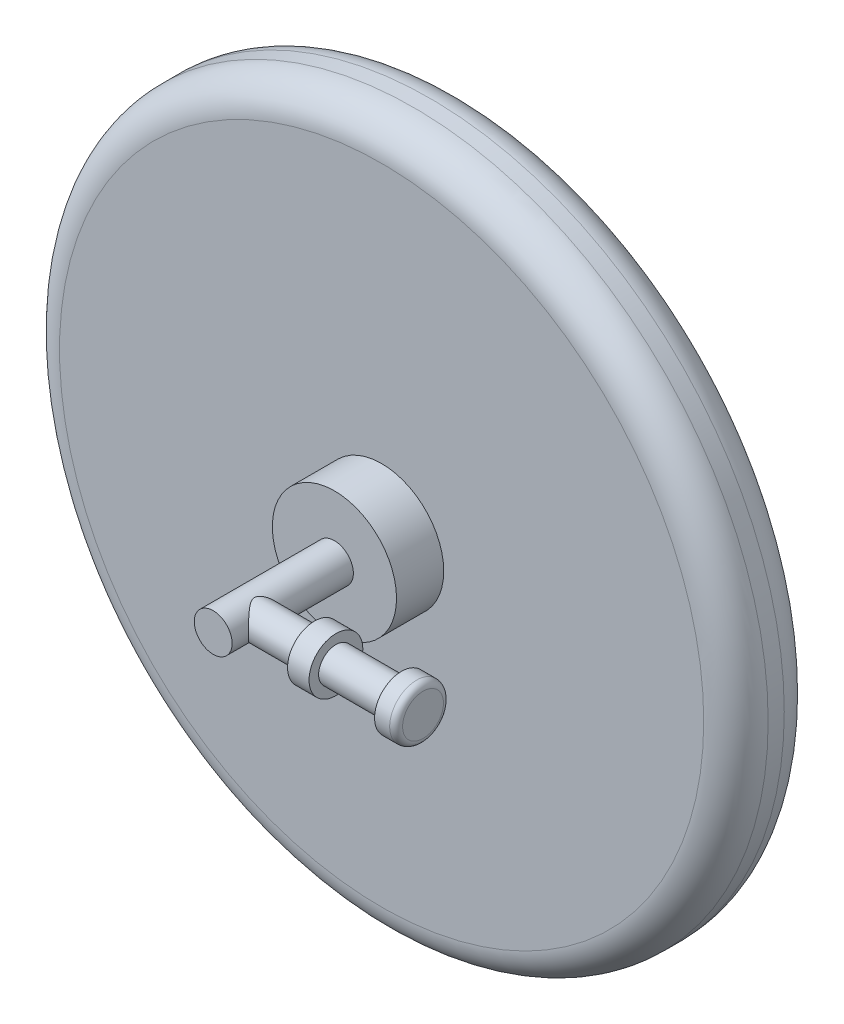
ISO-10303-21;
HEADER;
FILE_DESCRIPTION(('STEP AP214'),'2;1');
FILE_NAME('part.step','',(''),(''),'','','');
FILE_SCHEMA(('AUTOMOTIVE_DESIGN { 1 0 10303 214 1 1 1 1 }'));
ENDSEC;
DATA;
#1=APPLICATION_CONTEXT('core data for automotive mechanical design processes');
#2=APPLICATION_PROTOCOL_DEFINITION('international standard','automotive_design',2000,#1);
#3=PRODUCT_CONTEXT('',#1,'mechanical');
#4=PRODUCT('Part','Part','',(#3));
#5=PRODUCT_RELATED_PRODUCT_CATEGORY('part','',(#4));
#6=PRODUCT_DEFINITION_FORMATION('','',#4);
#7=PRODUCT_DEFINITION_CONTEXT('part definition',#1,'design');
#8=PRODUCT_DEFINITION('design','',#6,#7);
#9=PRODUCT_DEFINITION_SHAPE('','',#8);
#10=(LENGTH_UNIT() NAMED_UNIT(*) SI_UNIT(.MILLI.,.METRE.));
#11=(NAMED_UNIT(*) PLANE_ANGLE_UNIT() SI_UNIT($,.RADIAN.));
#12=(NAMED_UNIT(*) SI_UNIT($,.STERADIAN.) SOLID_ANGLE_UNIT());
#13=UNCERTAINTY_MEASURE_WITH_UNIT(LENGTH_MEASURE(1.E-05),#10,'distance_accuracy_value','');
#14=(GEOMETRIC_REPRESENTATION_CONTEXT(3) GLOBAL_UNCERTAINTY_ASSIGNED_CONTEXT((#13)) GLOBAL_UNIT_ASSIGNED_CONTEXT((#10,
#11,#12)) REPRESENTATION_CONTEXT('',''));
#15=CARTESIAN_POINT('',(0.,0.,0.));
#16=DIRECTION('',(0.,0.,1.));
#17=DIRECTION('',(1.,0.,0.));
#18=AXIS2_PLACEMENT_3D('',#15,#16,#17);
#19=CARTESIAN_POINT('',(53.3399999999999,-3.33066907387547E-13,131.7371));
#20=DIRECTION('',(1.,0.,0.));
#21=DIRECTION('',(0.,0.,-1.));
#22=AXIS2_PLACEMENT_3D('',#19,#20,#21);
#23=CYLINDRICAL_SURFACE('',#22,21.209);
#24=CARTESIAN_POINT('',(53.3399999999999,-3.33066907387547E-13,131.7371));
#25=DIRECTION('',(1.,0.,0.));
#26=DIRECTION('',(0.,0.,-1.));
#27=AXIS2_PLACEMENT_3D('',#24,#25,#26);
#28=CIRCLE('',#27,21.209);
#29=CARTESIAN_POINT('',(53.3399999999999,-3.33103699137749E-13,110.5281));
#30=VERTEX_POINT('',#29);
#31=EDGE_CURVE('E112',#30,#30,#28,.T.);
#32=ORIENTED_EDGE('',*,*,#31,.T.);
#33=EDGE_LOOP('',(#32));
#34=FACE_BOUND('',#33,.T.);
#35=CARTESIAN_POINT('',(70.3072,0.,131.7371));
#36=DIRECTION('',(1.,0.,0.));
#37=DIRECTION('',(0.,0.,-1.));
#38=AXIS2_PLACEMENT_3D('',#35,#36,#37);
#39=CIRCLE('',#38,21.209);
#40=CARTESIAN_POINT('',(70.3072,0.,110.5281));
#41=VERTEX_POINT('',#40);
#42=EDGE_CURVE('E115',#41,#41,#39,.T.);
#43=ORIENTED_EDGE('',*,*,#42,.F.);
#44=EDGE_LOOP('',(#43));
#45=FACE_BOUND('',#44,.T.);
#46=ADVANCED_FACE('F50',(#34,#45),#23,.T.);
#47=CARTESIAN_POINT('',(133.8072,-1.11022302462516E-13,131.7371));
#48=DIRECTION('',(-1.,0.,0.));
#49=DIRECTION('',(0.,0.,1.));
#50=AXIS2_PLACEMENT_3D('',#47,#48,#49);
#51=CYLINDRICAL_SURFACE('',#50,13.6525);
#52=CARTESIAN_POINT('',(14.9224999999986,-2.22044604925031E-13,145.389600000003));
#53=CARTESIAN_POINT('',(14.9224975751914,-0.314679827538271,145.389597544321));
#54=CARTESIAN_POINT('',(14.9125248063025,-0.62939866485721,145.378699056492));
#55=CARTESIAN_POINT('',(14.872855245779,-1.25611457254504,145.335322250677));
#56=CARTESIAN_POINT('',(14.8431551464077,-1.56811117757989,145.302840313733));
#57=CARTESIAN_POINT('',(14.7646687882556,-2.18699027334549,145.216918252252));
#58=CARTESIAN_POINT('',(14.7158686506134,-2.49386887568357,145.163462887503));
#59=CARTESIAN_POINT('',(14.6002191255131,-3.09996902881604,145.036604778444));
#60=CARTESIAN_POINT('',(14.533370060317,-3.39919071621962,144.963202390286));
#61=CARTESIAN_POINT('',(14.3834211802936,-3.98614699271213,144.798253375782));
#62=CARTESIAN_POINT('',(14.3004302572887,-4.27394379979169,144.706828276386));
#63=CARTESIAN_POINT('',(14.1193732823536,-4.83861850549161,144.50691781969));
#64=CARTESIAN_POINT('',(14.0213074854895,-5.11549658875677,144.398432751044));
#65=CARTESIAN_POINT('',(13.8116051417991,-5.65729319431543,144.165805616674));
#66=CARTESIAN_POINT('',(13.6999667353727,-5.92221007095474,144.041661405385));
#67=CARTESIAN_POINT('',(13.4646440151978,-6.43934111758879,143.779100512654));
#68=CARTESIAN_POINT('',(13.3409569739976,-6.69155239171886,143.640680599202));
#69=CARTESIAN_POINT('',(13.0313300560876,-7.28123667868312,143.292787041987));
#70=CARTESIAN_POINT('',(12.8403048273695,-7.61237856456286,143.077067053602));
#71=CARTESIAN_POINT('',(12.4414146958091,-8.24822303258853,142.623341396287));
#72=CARTESIAN_POINT('',(12.2335435749122,-8.5529157652426,142.385327493264));
#73=CARTESIAN_POINT('',(11.8041813694739,-9.13639753330821,141.889142232118));
#74=CARTESIAN_POINT('',(11.5826633068085,-9.41513233286339,141.630930655461));
#75=CARTESIAN_POINT('',(11.1298754337393,-9.94628830119558,141.096799307306));
#76=CARTESIAN_POINT('',(10.8986068580564,-10.1987127877111,140.820881775641));
#77=CARTESIAN_POINT('',(10.4240154952952,-10.6835731441048,140.24573822815));
#78=CARTESIAN_POINT('',(10.1805364245874,-10.9153770148227,139.946109597953));
#79=CARTESIAN_POINT('',(9.69072223121226,-11.3524721048894,139.330176359488));
#80=CARTESIAN_POINT('',(9.44438644512785,-11.5577570256918,139.013867814584));
#81=CARTESIAN_POINT('',(8.95397020950194,-11.9417003681107,138.364954708499));
#82=CARTESIAN_POINT('',(8.70988644105954,-12.1204071464977,138.032381242719));
#83=CARTESIAN_POINT('',(8.22954806902558,-12.4515195947944,137.349103969467));
#84=CARTESIAN_POINT('',(7.99328919724522,-12.6039398005091,136.998410322335));
#85=CARTESIAN_POINT('',(7.65376157648507,-12.8108609593027,136.460281669942));
#86=CARTESIAN_POINT('',(7.5441114608094,-12.8756601452394,136.280786964625));
#87=CARTESIAN_POINT('',(7.33035676779226,-12.9985397446387,135.916302754386));
#88=CARTESIAN_POINT('',(7.22625110271128,-13.0566214786056,135.731314338424));
#89=CARTESIAN_POINT('',(7.02538810098373,-13.1657888798679,135.355258483413));
#90=CARTESIAN_POINT('',(6.92863255718546,-13.2168728426859,135.16418957723));
#91=CARTESIAN_POINT('',(6.74491107072552,-13.3115690580062,134.77567321256));
#92=CARTESIAN_POINT('',(6.65794392979192,-13.3551822254066,134.578226538642));
#93=CARTESIAN_POINT('',(6.44304080054155,-13.4607039111655,134.042774063443));
#94=CARTESIAN_POINT('',(6.32625804897889,-13.5155247135241,133.698511814645));
#95=CARTESIAN_POINT('',(6.18995851577387,-13.5782160421476,133.170350197585));
#96=CARTESIAN_POINT('',(6.15102555420764,-13.5958479810356,132.992533056309));
#97=CARTESIAN_POINT('',(6.08795464387762,-13.6242069199327,132.633790605558));
#98=CARTESIAN_POINT('',(6.06380775496729,-13.6349380925697,132.45286724238));
#99=CARTESIAN_POINT('',(6.03153668170797,-13.6492453893752,132.087334836899));
#100=CARTESIAN_POINT('',(6.02358704236491,-13.6527435752274,131.902707075618));
#101=CARTESIAN_POINT('',(6.02475068554445,-13.652230019234,131.533519172679));
#102=CARTESIAN_POINT('',(6.03386370155856,-13.6482183946872,131.34895903001));
#103=CARTESIAN_POINT('',(6.06858959471379,-13.6328125458015,130.98139833469));
#104=CARTESIAN_POINT('',(6.09423245018983,-13.6214049079168,130.798401228955));
#105=CARTESIAN_POINT('',(6.160515198491,-13.5915549658269,130.435745217418));
#106=CARTESIAN_POINT('',(6.20115831634961,-13.5731111488252,130.256087038211));
#107=CARTESIAN_POINT('',(6.30936162816279,-13.5232196905045,129.848441393671));
#108=CARTESIAN_POINT('',(6.38132898217333,-13.4895383841549,129.621903527837));
#109=CARTESIAN_POINT('',(6.54234657955825,-13.4121834003213,129.176786863856));
#110=CARTESIAN_POINT('',(6.63140456322269,-13.3685051935405,128.958211725575));
#111=CARTESIAN_POINT('',(6.82273728916248,-13.2718794155735,128.528256368954));
#112=CARTESIAN_POINT('',(6.92505309742504,-13.2189028540759,128.316901198225));
#113=CARTESIAN_POINT('',(7.13936406545717,-13.1043985138799,127.901485262765));
#114=CARTESIAN_POINT('',(7.25136337510796,-13.0428670620311,127.697427678915));
#115=CARTESIAN_POINT('',(7.48141855114953,-12.9122704448851,127.297747305997));
#116=CARTESIAN_POINT('',(7.59941486024846,-12.8432737452117,127.102067573935));
#117=CARTESIAN_POINT('',(7.84036293038834,-12.6976206551566,126.716784776132));
#118=CARTESIAN_POINT('',(7.96331394929247,-12.6209654093779,126.527180807918));
#119=CARTESIAN_POINT('',(8.33749198574688,-12.3796260607544,125.966346525278));
#120=CARTESIAN_POINT('',(8.59388647309425,-12.2036557786005,125.60335837892));
#121=CARTESIAN_POINT('',(9.11188602043251,-11.8219481969501,124.896506241827));
#122=CARTESIAN_POINT('',(9.37349811113551,-11.6161680105925,124.55267080959));
#123=CARTESIAN_POINT('',(9.89547051359249,-11.1748581431841,123.883838147315));
#124=CARTESIAN_POINT('',(10.1558312008122,-10.9393380495099,123.558834895311));
#125=CARTESIAN_POINT('',(10.6891571293299,-10.4197624162495,122.904994568979));
#126=CARTESIAN_POINT('',(10.9616661171721,-10.1334251168763,122.577590530688));
#127=CARTESIAN_POINT('',(11.4943099734102,-9.52498689632797,121.946415219674));
#128=CARTESIAN_POINT('',(11.754441286443,-9.2028757870134,121.642650721438));
#129=CARTESIAN_POINT('',(12.2559919358447,-8.52346402048736,121.06282510077));
#130=CARTESIAN_POINT('',(12.497467473899,-8.16627705802708,120.786679968317));
#131=CARTESIAN_POINT('',(12.9567309026796,-7.41601450488629,120.265316414904));
#132=CARTESIAN_POINT('',(13.1745352929312,-7.02296426814433,120.020076432822));
#133=CARTESIAN_POINT('',(13.5056926892011,-6.35304608521437,119.649186862845));
#134=CARTESIAN_POINT('',(13.6280225892896,-6.08654375512208,119.512701523737));
#135=CARTESIAN_POINT('',(13.8590648023319,-5.54032391260236,119.255649507421));
#136=CARTESIAN_POINT('',(13.9677812156144,-5.26061041445309,119.135078036425));
#137=CARTESIAN_POINT('',(14.1698915228203,-4.68903268927405,118.911427865584));
#138=CARTESIAN_POINT('',(14.2632916098271,-4.39717343347163,118.808342094897));
#139=CARTESIAN_POINT('',(14.433186191478,-3.80259405092404,118.621149455957));
#140=CARTESIAN_POINT('',(14.5096801511983,-3.4998735808732,118.53704318823));
#141=CARTESIAN_POINT('',(14.6447612255352,-2.88311775544877,118.388702015802));
#142=CARTESIAN_POINT('',(14.7032083015935,-2.56901405836682,118.324622468221));
#143=CARTESIAN_POINT('',(14.8001209109226,-1.93405049569998,118.218453629828));
#144=CARTESIAN_POINT('',(14.8385865008323,-1.61319064926852,118.176364276684));
#145=CARTESIAN_POINT('',(14.8946184851817,-0.967612791381765,118.115075033616));
#146=CARTESIAN_POINT('',(14.9121940412547,-0.642896534366328,118.095865109574));
#147=CARTESIAN_POINT('',(14.926041805812,0.00751748209440716,118.080728430059));
#148=CARTESIAN_POINT('',(14.9223160443156,0.333215145054901,118.084799455908));
#149=CARTESIAN_POINT('',(14.895263352011,0.946347701304549,118.114374559911));
#150=CARTESIAN_POINT('',(14.8741654311028,1.23400450964006,118.137441346136));
#151=CARTESIAN_POINT('',(14.8156434578172,1.80561275932831,118.201472551436));
#152=CARTESIAN_POINT('',(14.7782208528509,2.08956452688634,118.242435383778));
#153=CARTESIAN_POINT('',(14.68773338588,2.65190843234713,118.341590589384));
#154=CARTESIAN_POINT('',(14.6346676150303,2.930300246221,118.399783963717));
#155=CARTESIAN_POINT('',(14.5138059764934,3.47988791681101,118.532514960515));
#156=CARTESIAN_POINT('',(14.4460093648211,3.75108340929836,118.607053408493));
#157=CARTESIAN_POINT('',(14.2952659212022,4.29025671110858,118.77308777444));
#158=CARTESIAN_POINT('',(14.2120431931275,4.55806167684733,118.864893038078));
#159=CARTESIAN_POINT('',(14.0325956881732,5.08374310688565,119.063296989029));
#160=CARTESIAN_POINT('',(13.9363659272237,5.34161571636675,119.169901347525));
#161=CARTESIAN_POINT('',(13.7322049824464,5.84651231370108,119.396693062669));
#162=CARTESIAN_POINT('',(13.624273487558,6.09353601291833,119.516880780399));
#163=CARTESIAN_POINT('',(13.397975123499,6.57619583175903,119.769700072679));
#164=CARTESIAN_POINT('',(13.2796060477296,6.81182952705335,119.902334278912));
#165=CARTESIAN_POINT('',(12.9721815704597,7.38621986844256,120.248135872684));
#166=CARTESIAN_POINT('',(12.7773682457962,7.71764910245693,120.468418979815));
#167=CARTESIAN_POINT('',(12.3709982735955,8.35355765056831,120.931376416537));
#168=CARTESIAN_POINT('',(12.1594345036031,8.65802538253071,121.174060278504));
#169=CARTESIAN_POINT('',(11.722785890379,9.24067777418813,121.679774760062));
#170=CARTESIAN_POINT('',(11.4976701778113,9.51879840465243,121.942852257852));
#171=CARTESIAN_POINT('',(11.0379497077396,10.0482622173845,122.486842928186));
#172=CARTESIAN_POINT('',(10.8033463555348,10.2996093454191,122.767753462805));
#173=CARTESIAN_POINT('',(10.3225060531548,10.7817200066946,123.353041744378));
#174=CARTESIAN_POINT('',(10.076125171988,11.0118552142972,123.657817665561));
#175=CARTESIAN_POINT('',(9.58106544670476,11.4451900490261,124.284346309744));
#176=CARTESIAN_POINT('',(9.33238599422417,11.6483823133072,124.606103639901));
#177=CARTESIAN_POINT('',(8.83819313515808,12.0276409926064,125.266297001349));
#178=CARTESIAN_POINT('',(8.59267433201192,12.2037615659047,125.604697896714));
#179=CARTESIAN_POINT('',(8.11083591587316,12.529147094128,126.300307917774));
#180=CARTESIAN_POINT('',(7.87451055745883,12.6784290401503,126.657504957436));
#181=CARTESIAN_POINT('',(7.54024756812105,12.8779452320499,127.200169066158));
#182=CARTESIAN_POINT('',(7.43489824437569,12.9389786266935,127.377148068273));
#183=CARTESIAN_POINT('',(7.23002467798922,13.054560199473,127.736491885732));
#184=CARTESIAN_POINT('',(7.13049925411338,13.1091096950392,127.918855597552));
#185=CARTESIAN_POINT('',(6.93910778082855,13.2114180899863,128.28947610492));
#186=CARTESIAN_POINT('',(6.84724180515399,13.2591769239994,128.477732957175));
#187=CARTESIAN_POINT('',(6.67356277124843,13.347436325872,128.860413232918));
#188=CARTESIAN_POINT('',(6.59174841082927,13.3879378342314,129.054835853515));
#189=CARTESIAN_POINT('',(6.39067421523263,13.4855408507957,129.582330581683));
#190=CARTESIAN_POINT('',(6.28282075182694,13.5357041348976,129.921412020345));
#191=CARTESIAN_POINT('',(6.15976686483066,13.5919211621276,130.44066735547));
#192=CARTESIAN_POINT('',(6.1252200887327,13.6074821546348,130.615326640972));
#193=CARTESIAN_POINT('',(6.07062508052043,13.631926532681,130.967408483634));
#194=CARTESIAN_POINT('',(6.05057553565372,13.6408105228383,131.144830789112));
#195=CARTESIAN_POINT('',(6.02604267917548,13.6516667860076,131.502501815424));
#196=CARTESIAN_POINT('',(6.02169414026224,13.653579218611,131.68276172925));
#197=CARTESIAN_POINT('',(6.02920703386713,13.6502631097366,132.042872374905));
#198=CARTESIAN_POINT('',(6.04106852955336,13.6450345404313,132.222723105138));
#199=CARTESIAN_POINT('',(6.08030860058536,13.6275935220355,132.580681058484));
#200=CARTESIAN_POINT('',(6.10771513430348,13.615368489168,132.758784550358));
#201=CARTESIAN_POINT('',(6.17654952574254,13.5842797957925,133.111695525556));
#202=CARTESIAN_POINT('',(6.21798341103469,13.5654132812923,133.28650155781));
#203=CARTESIAN_POINT('',(6.3296815659519,13.5137384820222,133.692884674586));
#204=CARTESIAN_POINT('',(6.40496012179398,13.4783599970829,133.922751931909));
#205=CARTESIAN_POINT('',(6.57271786572543,13.3973520687946,134.374219681329));
#206=CARTESIAN_POINT('',(6.66520584911065,13.3517173812745,134.595815876461));
#207=CARTESIAN_POINT('',(6.86338943488607,13.2509353955213,135.031585788013));
#208=CARTESIAN_POINT('',(6.96912581939267,13.195758515351,135.245733857884));
#209=CARTESIAN_POINT('',(7.19018672675384,13.0766203885735,135.666552707295));
#210=CARTESIAN_POINT('',(7.30551496960273,13.0126557274878,135.873220540771));
#211=CARTESIAN_POINT('',(7.54180536834398,12.8771319496393,136.277495141848));
#212=CARTESIAN_POINT('',(7.66269331263527,12.805662218217,136.475175614228));
#213=CARTESIAN_POINT('',(7.90926855587279,12.6548567977047,136.864367585632));
#214=CARTESIAN_POINT('',(8.03495517729276,12.5755222165478,137.055879948544));
#215=CARTESIAN_POINT('',(8.41710288602661,12.32581827393,137.622299207084));
#216=CARTESIAN_POINT('',(8.67849442380778,12.1438369982863,137.988827762346));
#217=CARTESIAN_POINT('',(9.20583056651171,11.7491524686458,138.702334038914));
#218=CARTESIAN_POINT('',(9.47178130400533,11.5364044114608,139.04928220446));
#219=CARTESIAN_POINT('',(10.0016799353075,11.0801455545388,139.723763918222));
#220=CARTESIAN_POINT('',(10.265628439372,10.8366445630096,140.051303607773));
#221=CARTESIAN_POINT('',(10.8034750117293,10.3014130455226,140.707173969814));
#222=CARTESIAN_POINT('',(11.0769074843494,10.0075783464679,141.03417711699));
#223=CARTESIAN_POINT('',(11.6103911841914,9.38341193727416,141.663771757564));
#224=CARTESIAN_POINT('',(11.8704384362202,9.05306947554586,141.966356013927));
#225=CARTESIAN_POINT('',(12.3706079618949,8.35657429334805,142.542751424331));
#226=CARTESIAN_POINT('',(12.6107919503238,7.99054083234755,142.816652461776));
#227=CARTESIAN_POINT('',(13.0660527955357,7.22207463424112,143.332188795421));
#228=CARTESIAN_POINT('',(13.2811488190218,6.81967010666004,143.573848743744));
#229=CARTESIAN_POINT('',(13.6041728071258,6.13928266209438,143.934930076539));
#230=CARTESIAN_POINT('',(13.7218085668687,5.87198545775721,144.065954194271));
#231=CARTESIAN_POINT('',(13.9433144045369,5.32466564953331,144.312021202634));
#232=CARTESIAN_POINT('',(14.0471885771293,5.04464686431921,144.427068847449));
#233=CARTESIAN_POINT('',(14.2394480752298,4.47324218721984,144.639567791335));
#234=CARTESIAN_POINT('',(14.3278512286619,4.1818698584716,144.737039348081));
#235=CARTESIAN_POINT('',(14.4877456609149,3.58893453465196,144.913058422617));
#236=CARTESIAN_POINT('',(14.5592395559449,3.28737312430269,144.991608867927));
#237=CARTESIAN_POINT('',(14.6707850462373,2.74039440267717,145.114026980449));
#238=CARTESIAN_POINT('',(14.7142874270079,2.49652598287755,145.161714895209));
#239=CARTESIAN_POINT('',(14.7893242588457,2.00468746297869,145.243918458963));
#240=CARTESIAN_POINT('',(14.8208562817352,1.75671654132475,145.278431435439));
#241=CARTESIAN_POINT('',(14.8714950660151,1.25796361441635,145.333836450067));
#242=CARTESIAN_POINT('',(14.8906004470211,1.0071813000113,145.354726975002));
#243=CARTESIAN_POINT('',(14.9161022817357,0.504274102697909,145.382607979753));
#244=CARTESIAN_POINT('',(14.9225019429707,0.252149574747004,145.389601967714));
#245=CARTESIAN_POINT('',(14.9224999999986,-2.22044604925031E-13,145.389600000003));
#246=B_SPLINE_CURVE_WITH_KNOTS('',3,(#52,#53,#54,#55,#56,#57,#58,#59,#60,#61,#62,#63,#64,#65,
#66,#67,#68,#69,#70,#71,#72,#73,#74,#75,#76,#77,#78,#79,#80,#81,#82,#83,#84,#85,#86,#87,#88,#89,
#90,#91,#92,#93,#94,#95,#96,#97,#98,#99,#100,#101,#102,#103,#104,#105,#106,#107,#108,#109,#110,
#111,#112,#113,#114,#115,#116,#117,#118,#119,#120,#121,#122,#123,#124,#125,#126,#127,#128,#129,
#130,#131,#132,#133,#134,#135,#136,#137,#138,#139,#140,#141,#142,#143,#144,#145,#146,#147,#148,
#149,#150,#151,#152,#153,#154,#155,#156,#157,#158,#159,#160,#161,#162,#163,#164,#165,#166,#167,
#168,#169,#170,#171,#172,#173,#174,#175,#176,#177,#178,#179,#180,#181,#182,#183,#184,#185,#186,
#187,#188,#189,#190,#191,#192,#193,#194,#195,#196,#197,#198,#199,#200,#201,#202,#203,#204,#205,
#206,#207,#208,#209,#210,#211,#212,#213,#214,#215,#216,#217,#218,#219,#220,#221,#222,#223,#224,
#225,#226,#227,#228,#229,#230,#231,#232,#233,#234,#235,#236,#237,#238,#239,#240,#241,#242,#243,
#244,#245),.UNSPECIFIED.,.T.,.F.,(4,2,2,2,2,2,2,2,2,2,2,2,2,2,2,2,2,2,2,2,2,2,2,2,2,2,2,2,2,2,2,
2,2,2,2,2,2,2,2,2,2,2,2,2,2,2,2,2,2,2,2,2,2,2,2,2,2,2,2,2,2,2,2,2,2,2,2,2,2,2,2,2,2,2,2,2,2,2,2,
2,2,2,2,2,2,2,2,2,2,2,2,2,2,2,2,2,4),(0.,0.943764262334284,1.88768680821936,2.83229652365611,
3.7768893742767,4.71531823025196,5.65373120979487,6.59227290767058,7.53102755931428,
8.8459439302781,10.161347885461,11.4794412876045,12.797368276167,14.1472072963365,
15.497366331167,16.845037992936,18.1919620203394,18.8520463112815,19.5120006227363,
20.1721153973828,20.8321492743263,21.930561528355,22.4785867706085,23.026280330719,
23.5798453873558,24.1334017977096,24.6879649671694,25.2426474363851,25.9616509492821,
26.6809808683075,27.4025946904589,28.1245193090028,28.840308964064,29.5559918008312,
30.9883144888296,32.4227186792645,33.8566616298309,35.3946544970159,36.9330865028432,
38.4666868530317,39.9992112859239,40.9687218970699,41.9379397894318,42.9067648116648,
43.8756204839373,44.8518154887326,45.8280077264252,46.8037716824271,47.7794426495075,
48.6464619267387,49.5134043462327,50.380397143747,51.2474337391557,52.1318117891503,
53.0165296833064,53.9012711011995,54.7862000119085,56.113462876786,57.4412931695951,
58.7722717699661,60.1030539440914,61.4653476113647,62.8280127961681,64.1879153899937,
65.5469539965228,66.1912036864441,66.8353222499963,67.4794470135033,68.1234882423685,
69.1969629524867,69.7325229218979,70.2680343892405,70.8081317412081,71.348231197861,
71.8893051392309,72.430611876501,73.162736413882,73.8952361541515,74.6300488288868,
75.3651478256901,76.0923155846535,76.8193810515907,78.2744595947225,79.7316787963523,
81.1884344069479,82.7397076045711,84.291438878002,85.838152092898,87.3836758006516,
88.3431063275563,89.3022507381642,90.2602825013449,91.2181659402597,91.9743478033769,
92.7306829755402,93.4871021490884,94.2433303422682),.UNSPECIFIED.);
#247=CARTESIAN_POINT('',(14.9224999999986,-2.22044604925031E-13,145.389600000003));
#248=VERTEX_POINT('',#247);
#249=EDGE_CURVE('E70',#248,#248,#246,.T.);
#250=ORIENTED_EDGE('',*,*,#249,.T.);
#251=EDGE_LOOP('',(#250));
#252=FACE_BOUND('',#251,.T.);
#253=CARTESIAN_POINT('',(53.3399999999999,-3.33066907387547E-13,131.7371));
#254=DIRECTION('',(1.,0.,0.));
#255=DIRECTION('',(0.,0.,-1.));
#256=AXIS2_PLACEMENT_3D('',#253,#254,#255);
#257=CIRCLE('',#256,13.6525);
#258=CARTESIAN_POINT('',(53.3399999999999,-3.33090590699803E-13,118.0846));
#259=VERTEX_POINT('',#258);
#260=EDGE_CURVE('E65',#259,#259,#257,.T.);
#261=ORIENTED_EDGE('',*,*,#260,.F.);
#262=EDGE_LOOP('',(#261));
#263=FACE_BOUND('',#262,.T.);
#264=ADVANCED_FACE('F85',(#252,#263),#51,.T.);
#265=CARTESIAN_POINT('',(-1.33226762955019E-12,-1.66533453693773E-13,158.216600000001));
#266=DIRECTION('',(0.,0.,-1.));
#267=DIRECTION('',(-1.,0.,0.));
#268=AXIS2_PLACEMENT_3D('',#265,#266,#267);
#269=CYLINDRICAL_SURFACE('',#268,14.9225);
#270=CARTESIAN_POINT('',(-1.33226762955019E-12,-1.66533453693773E-13,158.216600000001));
#271=DIRECTION('',(0.,0.,1.));
#272=DIRECTION('',(1.,0.,0.));
#273=AXIS2_PLACEMENT_3D('',#270,#271,#272);
#274=CIRCLE('',#273,14.9225);
#275=CARTESIAN_POINT('',(14.9224999999987,-1.69853490383154E-13,158.216600000001));
#276=VERTEX_POINT('',#275);
#277=EDGE_CURVE('E119',#276,#276,#274,.T.);
#278=ORIENTED_EDGE('',*,*,#277,.F.);
#279=EDGE_LOOP('',(#278));
#280=FACE_BOUND('',#279,.T.);
#281=CARTESIAN_POINT('',(0.,-4.44089209850063E-13,62.611));
#282=DIRECTION('',(0.,0.,1.));
#283=DIRECTION('',(1.,0.,0.));
#284=AXIS2_PLACEMENT_3D('',#281,#282,#283);
#285=CIRCLE('',#284,14.9225);
#286=CARTESIAN_POINT('',(14.9225,-4.47409246539443E-13,62.611));
#287=VERTEX_POINT('',#286);
#288=EDGE_CURVE('E78',#287,#287,#285,.T.);
#289=ORIENTED_EDGE('',*,*,#288,.T.);
#290=EDGE_LOOP('',(#289));
#291=FACE_BOUND('',#290,.T.);
#292=ORIENTED_EDGE('',*,*,#249,.F.);
#293=EDGE_LOOP('',(#292));
#294=FACE_BOUND('',#293,.T.);
#295=ADVANCED_FACE('F81',(#280,#291,#294),#269,.T.);
#296=CARTESIAN_POINT('',(0.,-2.22044604925031E-13,-38.1));
#297=DIRECTION('',(0.,0.,1.));
#298=DIRECTION('',(1.,0.,0.));
#299=AXIS2_PLACEMENT_3D('',#296,#297,#298);
#300=CYLINDRICAL_SURFACE('',#299,279.4);
#301=CARTESIAN_POINT('',(0.,0.,-12.6999999999997));
#302=DIRECTION('',(0.,0.,1.));
#303=DIRECTION('',(1.,0.,0.));
#304=AXIS2_PLACEMENT_3D('',#301,#302,#303);
#305=CIRCLE('',#304,279.4);
#306=CARTESIAN_POINT('',(279.4,0.,-12.6999999999997));
#307=VERTEX_POINT('',#306);
#308=EDGE_CURVE('E137',#307,#307,#305,.T.);
#309=ORIENTED_EDGE('',*,*,#308,.T.);
#310=EDGE_LOOP('',(#309));
#311=FACE_BOUND('',#310,.T.);
#312=CARTESIAN_POINT('',(0.,0.,0.));
#313=DIRECTION('',(0.,0.,1.));
#314=DIRECTION('',(1.,0.,0.));
#315=AXIS2_PLACEMENT_3D('',#312,#313,#314);
#316=CIRCLE('',#315,279.4);
#317=CARTESIAN_POINT('',(279.4,0.,0.));
#318=VERTEX_POINT('',#317);
#319=EDGE_CURVE('E132',#318,#318,#316,.F.);
#320=ORIENTED_EDGE('',*,*,#319,.T.);
#321=EDGE_LOOP('',(#320));
#322=FACE_BOUND('',#321,.T.);
#323=ADVANCED_FACE('F162',(#311,#322),#300,.T.);
#324=CARTESIAN_POINT('',(0.,-2.22044604925031E-13,-38.1));
#325=DIRECTION('',(0.,0.,1.));
#326=DIRECTION('',(1.,0.,0.));
#327=AXIS2_PLACEMENT_3D('',#324,#325,#326);
#328=PLANE('',#327);
#329=CARTESIAN_POINT('',(0.,-2.22044604925031E-13,-38.1));
#330=DIRECTION('',(0.,0.,1.));
#331=DIRECTION('',(1.,0.,0.));
#332=AXIS2_PLACEMENT_3D('',#329,#330,#331);
#333=CIRCLE('',#332,254.);
#334=CARTESIAN_POINT('',(254.,-2.78555867722994E-13,-38.1));
#335=VERTEX_POINT('',#334);
#336=EDGE_CURVE('E139',#335,#335,#333,.F.);
#337=ORIENTED_EDGE('',*,*,#336,.T.);
#338=EDGE_LOOP('',(#337));
#339=FACE_BOUND('',#338,.T.);
#340=ADVANCED_FACE('F165',(#339),#328,.F.);
#341=CARTESIAN_POINT('',(0.,1.66533453693773E-13,25.3999999999999));
#342=DIRECTION('',(0.,0.,1.));
#343=DIRECTION('',(1.,0.,0.));
#344=AXIS2_PLACEMENT_3D('',#341,#342,#343);
#345=PLANE('',#344);
#346=CARTESIAN_POINT('',(0.,1.66533453693773E-13,25.3999999999999));
#347=DIRECTION('',(0.,0.,1.));
#348=DIRECTION('',(1.,0.,0.));
#349=AXIS2_PLACEMENT_3D('',#346,#347,#348);
#350=CIRCLE('',#349,48.9585);
#351=CARTESIAN_POINT('',(48.9585,1.55640907789466E-13,25.3999999999999));
#352=VERTEX_POINT('',#351);
#353=EDGE_CURVE('E126',#352,#352,#350,.T.);
#354=ORIENTED_EDGE('',*,*,#353,.F.);
#355=EDGE_LOOP('',(#354));
#356=FACE_BOUND('',#355,.T.);
#357=CARTESIAN_POINT('',(0.,1.66533453693773E-13,25.3999999999999));
#358=DIRECTION('',(0.,0.,1.));
#359=DIRECTION('',(1.,0.,0.));
#360=AXIS2_PLACEMENT_3D('',#357,#358,#359);
#361=CIRCLE('',#360,254.);
#362=CARTESIAN_POINT('',(254.,1.1002219089581E-13,25.3999999999999));
#363=VERTEX_POINT('',#362);
#364=EDGE_CURVE('E79',#363,#363,#361,.T.);
#365=ORIENTED_EDGE('',*,*,#364,.T.);
#366=EDGE_LOOP('',(#365));
#367=FACE_BOUND('',#366,.T.);
#368=ADVANCED_FACE('F146',(#356,#367),#345,.T.);
#369=CARTESIAN_POINT('',(0.,0.,-12.6999999999997));
#370=DIRECTION('',(0.,0.,1.));
#371=DIRECTION('',(1.,0.,0.));
#372=AXIS2_PLACEMENT_3D('',#369,#370,#371);
#373=TOROIDAL_SURFACE('',#372,254.,25.4);
#374=ORIENTED_EDGE('',*,*,#336,.F.);
#375=EDGE_LOOP('',(#374));
#376=FACE_BOUND('',#375,.T.);
#377=ORIENTED_EDGE('',*,*,#308,.F.);
#378=EDGE_LOOP('',(#377));
#379=FACE_BOUND('',#378,.T.);
#380=ADVANCED_FACE('F150',(#376,#379),#373,.T.);
#381=CARTESIAN_POINT('',(0.,0.,0.));
#382=DIRECTION('',(0.,0.,1.));
#383=DIRECTION('',(1.,0.,0.));
#384=AXIS2_PLACEMENT_3D('',#381,#382,#383);
#385=TOROIDAL_SURFACE('',#384,254.,25.4);
#386=ORIENTED_EDGE('',*,*,#319,.F.);
#387=EDGE_LOOP('',(#386));
#388=FACE_BOUND('',#387,.T.);
#389=ORIENTED_EDGE('',*,*,#364,.F.);
#390=EDGE_LOOP('',(#389));
#391=FACE_BOUND('',#390,.T.);
#392=ADVANCED_FACE('F148',(#388,#391),#385,.T.);
#393=CARTESIAN_POINT('',(0.,-4.44089209850063E-13,62.611));
#394=DIRECTION('',(0.,0.,-1.));
#395=DIRECTION('',(-1.,0.,0.));
#396=AXIS2_PLACEMENT_3D('',#393,#394,#395);
#397=CYLINDRICAL_SURFACE('',#396,48.9585);
#398=CARTESIAN_POINT('',(0.,-4.44089209850063E-13,62.611));
#399=DIRECTION('',(0.,0.,1.));
#400=DIRECTION('',(1.,0.,0.));
#401=AXIS2_PLACEMENT_3D('',#398,#399,#400);
#402=CIRCLE('',#401,48.9585);
#403=CARTESIAN_POINT('',(48.9585,-4.5498175575437E-13,62.611));
#404=VERTEX_POINT('',#403);
#405=EDGE_CURVE('E129',#404,#404,#402,.T.);
#406=ORIENTED_EDGE('',*,*,#405,.F.);
#407=EDGE_LOOP('',(#406));
#408=FACE_BOUND('',#407,.T.);
#409=ORIENTED_EDGE('',*,*,#353,.T.);
#410=EDGE_LOOP('',(#409));
#411=FACE_BOUND('',#410,.T.);
#412=ADVANCED_FACE('F102',(#408,#411),#397,.T.);
#413=CARTESIAN_POINT('',(0.,-4.44089209850063E-13,62.611));
#414=DIRECTION('',(0.,0.,1.));
#415=DIRECTION('',(1.,0.,0.));
#416=AXIS2_PLACEMENT_3D('',#413,#414,#415);
#417=PLANE('',#416);
#418=ORIENTED_EDGE('',*,*,#288,.F.);
#419=EDGE_LOOP('',(#418));
#420=FACE_BOUND('',#419,.T.);
#421=ORIENTED_EDGE('',*,*,#405,.T.);
#422=EDGE_LOOP('',(#421));
#423=FACE_BOUND('',#422,.T.);
#424=ADVANCED_FACE('F94',(#420,#423),#417,.T.);
#425=CARTESIAN_POINT('',(-1.33226762955019E-12,-1.66533453693773E-13,158.216600000001));
#426=DIRECTION('',(0.,0.,1.));
#427=DIRECTION('',(1.,0.,0.));
#428=AXIS2_PLACEMENT_3D('',#425,#426,#427);
#429=PLANE('',#428);
#430=ORIENTED_EDGE('',*,*,#277,.T.);
#431=EDGE_LOOP('',(#430));
#432=FACE_BOUND('',#431,.T.);
#433=ADVANCED_FACE('F91',(#432),#429,.T.);
#434=CARTESIAN_POINT('',(53.3399999999999,-3.33066907387547E-13,131.7371));
#435=DIRECTION('',(1.,0.,0.));
#436=DIRECTION('',(0.,0.,-1.));
#437=AXIS2_PLACEMENT_3D('',#434,#435,#436);
#438=PLANE('',#437);
#439=ORIENTED_EDGE('',*,*,#260,.T.);
#440=EDGE_LOOP('',(#439));
#441=FACE_BOUND('',#440,.T.);
#442=ORIENTED_EDGE('',*,*,#31,.F.);
#443=EDGE_LOOP('',(#442));
#444=FACE_BOUND('',#443,.T.);
#445=ADVANCED_FACE('F93',(#441,#444),#438,.F.);
#446=CARTESIAN_POINT('',(70.3072,0.,131.7371));
#447=DIRECTION('',(1.,0.,0.));
#448=DIRECTION('',(0.,0.,-1.));
#449=AXIS2_PLACEMENT_3D('',#446,#447,#448);
#450=PLANE('',#449);
#451=CARTESIAN_POINT('',(70.3072,0.,131.7371));
#452=DIRECTION('',(1.,0.,0.));
#453=DIRECTION('',(0.,0.,-1.));
#454=AXIS2_PLACEMENT_3D('',#451,#452,#453);
#455=CIRCLE('',#454,13.6525);
#456=CARTESIAN_POINT('',(70.3072,-3.21548833222185E-13,145.3896));
#457=VERTEX_POINT('',#456);
#458=EDGE_CURVE('E61',#457,#457,#455,.T.);
#459=ORIENTED_EDGE('',*,*,#458,.F.);
#460=EDGE_LOOP('',(#459));
#461=FACE_BOUND('',#460,.T.);
#462=ORIENTED_EDGE('',*,*,#42,.T.);
#463=EDGE_LOOP('',(#462));
#464=FACE_BOUND('',#463,.T.);
#465=ADVANCED_FACE('F100',(#461,#464),#450,.T.);
#466=CARTESIAN_POINT('',(121.9708,-3.33066907387547E-13,131.7371));
#467=DIRECTION('',(-1.,0.,0.));
#468=DIRECTION('',(0.,0.,1.));
#469=AXIS2_PLACEMENT_3D('',#466,#467,#468);
#470=CYLINDRICAL_SURFACE('',#469,13.6525);
#471=CARTESIAN_POINT('',(121.9708,-3.33066907387547E-13,131.7371));
#472=DIRECTION('',(1.,0.,0.));
#473=DIRECTION('',(0.,0.,-1.));
#474=AXIS2_PLACEMENT_3D('',#471,#472,#473);
#475=CIRCLE('',#474,13.6525);
#476=CARTESIAN_POINT('',(121.9708,-3.33043224075291E-13,145.3896));
#477=VERTEX_POINT('',#476);
#478=EDGE_CURVE('E117',#477,#477,#475,.T.);
#479=CARTESIAN_POINT('',(121.9708,-3.33043224075291E-13,145.3896));
#480=CARTESIAN_POINT('',(121.4326375,-3.32923490837238E-13,145.3896));
#481=CARTESIAN_POINT('',(120.894475,-3.32803757599185E-13,145.3896));
#482=CARTESIAN_POINT('',(119.81815,-3.32564291123078E-13,145.3896));
#483=CARTESIAN_POINT('',(119.2799875,-3.32444557885025E-13,145.3896));
#484=CARTESIAN_POINT('',(118.2036625,-3.32205091408919E-13,145.3896));
#485=CARTESIAN_POINT('',(117.6655,-3.32085358170866E-13,145.3896));
#486=CARTESIAN_POINT('',(116.589175,-3.31845891694759E-13,145.3896));
#487=CARTESIAN_POINT('',(116.0510125,-3.31726158456706E-13,145.3896));
#488=CARTESIAN_POINT('',(114.9746875,-3.314866919806E-13,145.3896));
#489=CARTESIAN_POINT('',(114.436525,-3.31366958742547E-13,145.3896));
#490=CARTESIAN_POINT('',(113.3602,-3.3112749226644E-13,145.3896));
#491=CARTESIAN_POINT('',(112.8220375,-3.31007759028387E-13,145.3896));
#492=CARTESIAN_POINT('',(111.7457125,-3.30768292552281E-13,145.3896));
#493=CARTESIAN_POINT('',(111.20755,-3.30648559314227E-13,145.3896));
#494=CARTESIAN_POINT('',(110.131225,-3.30409092838121E-13,145.3896));
#495=CARTESIAN_POINT('',(109.5930625,-3.30289359600068E-13,145.3896));
#496=CARTESIAN_POINT('',(108.5167375,-3.30049893123962E-13,145.3896));
#497=CARTESIAN_POINT('',(107.978575,-3.29930159885908E-13,145.3896));
#498=CARTESIAN_POINT('',(106.90225,-3.29690693409802E-13,145.3896));
#499=CARTESIAN_POINT('',(106.3640875,-3.29570960171749E-13,145.3896));
#500=CARTESIAN_POINT('',(105.2877625,-3.29331493695642E-13,145.3896));
#501=CARTESIAN_POINT('',(104.7496,-3.29211760457589E-13,145.3896));
#502=CARTESIAN_POINT('',(103.673275,-3.28972293981483E-13,145.3896));
#503=CARTESIAN_POINT('',(103.1351125,-3.2885256074343E-13,145.3896));
#504=CARTESIAN_POINT('',(102.0587875,-3.28613094267323E-13,145.3896));
#505=CARTESIAN_POINT('',(101.520625,-3.2849336102927E-13,145.3896));
#506=CARTESIAN_POINT('',(100.4443,-3.28253894553164E-13,145.3896));
#507=CARTESIAN_POINT('',(99.9061375,-3.28134161315111E-13,145.3896));
#508=CARTESIAN_POINT('',(98.8298125,-3.27894694839004E-13,145.3896));
#509=CARTESIAN_POINT('',(98.29165,-3.27774961600951E-13,145.3896));
#510=CARTESIAN_POINT('',(97.215325,-3.27535495124845E-13,145.3896));
#511=CARTESIAN_POINT('',(96.6771625,-3.27415761886791E-13,145.3896));
#512=CARTESIAN_POINT('',(95.6008375,-3.27176295410685E-13,145.3896));
#513=CARTESIAN_POINT('',(95.062675,-3.27056562172632E-13,145.3896));
#514=CARTESIAN_POINT('',(93.98635,-3.26817095696526E-13,145.3896));
#515=CARTESIAN_POINT('',(93.4481875,-3.26697362458472E-13,145.3896));
#516=CARTESIAN_POINT('',(92.3718625,-3.26457895982366E-13,145.3896));
#517=CARTESIAN_POINT('',(91.8337,-3.26338162744313E-13,145.3896));
#518=CARTESIAN_POINT('',(90.757375,-3.26098696268206E-13,145.3896));
#519=CARTESIAN_POINT('',(90.2192125,-3.25978963030153E-13,145.3896));
#520=CARTESIAN_POINT('',(89.1428875,-3.25739496554047E-13,145.3896));
#521=CARTESIAN_POINT('',(88.604725,-3.25619763315994E-13,145.3896));
#522=CARTESIAN_POINT('',(87.5284,-3.25380296839887E-13,145.3896));
#523=CARTESIAN_POINT('',(86.9902375,-3.25260563601834E-13,145.3896));
#524=CARTESIAN_POINT('',(85.9139125,-3.25021097125728E-13,145.3896));
#525=CARTESIAN_POINT('',(85.37575,-3.24901363887675E-13,145.3896));
#526=CARTESIAN_POINT('',(84.299425,-3.24661897411568E-13,145.3896));
#527=CARTESIAN_POINT('',(83.7612625,-3.24542164173515E-13,145.3896));
#528=CARTESIAN_POINT('',(82.6849375,-3.24302697697409E-13,145.3896));
#529=CARTESIAN_POINT('',(82.146775,-3.24182964459355E-13,145.3896));
#530=CARTESIAN_POINT('',(81.07045,-3.23943497983249E-13,145.3896));
#531=CARTESIAN_POINT('',(80.5322875,-3.23823764745196E-13,145.3896));
#532=CARTESIAN_POINT('',(79.4559625,-3.2358429826909E-13,145.3896));
#533=CARTESIAN_POINT('',(78.9178,-3.23464565031036E-13,145.3896));
#534=CARTESIAN_POINT('',(77.841475,-3.2322509855493E-13,145.3896));
#535=CARTESIAN_POINT('',(77.3033125,-3.23105365316877E-13,145.3896));
#536=CARTESIAN_POINT('',(76.2269875,-3.2286589884077E-13,145.3896));
#537=CARTESIAN_POINT('',(75.688825,-3.22746165602717E-13,145.3896));
#538=CARTESIAN_POINT('',(74.6125,-3.22506699126611E-13,145.3896));
#539=CARTESIAN_POINT('',(74.0743375,-3.22386965888558E-13,145.3896));
#540=CARTESIAN_POINT('',(72.9980125,-3.22147499412451E-13,145.3896));
#541=CARTESIAN_POINT('',(72.45985,-3.22027766174398E-13,145.3896));
#542=CARTESIAN_POINT('',(71.383525,-3.21788299698292E-13,145.3896));
#543=CARTESIAN_POINT('',(70.8453625,-3.21668566460239E-13,145.3896));
#544=CARTESIAN_POINT('',(70.3072,-3.21548833222185E-13,145.3896));
#545=B_SPLINE_CURVE_WITH_KNOTS('',3,(#479,#480,#481,#482,#483,#484,#485,#486,#487,#488,#489,
#490,#491,#492,#493,#494,#495,#496,#497,#498,#499,#500,#501,#502,#503,#504,#505,#506,#507,#508,
#509,#510,#511,#512,#513,#514,#515,#516,#517,#518,#519,#520,#521,#522,#523,#524,#525,#526,#527,
#528,#529,#530,#531,#532,#533,#534,#535,#536,#537,#538,#539,#540,#541,#542,#543,#544),
.UNSPECIFIED.,.F.,.F.,(4,2,2,2,2,2,2,2,2,2,2,2,2,2,2,2,2,2,2,2,2,2,2,2,2,2,2,2,2,2,2,2,4),(0.,
1.61448750000001,3.22897499999999,4.84346250000001,6.45794999999999,8.0724375,9.68692499999998,
11.3014125,12.9159,14.5303875,16.144875,17.7593625,19.37385,20.9883375,22.602825,24.2173125,
25.8318,27.4462875,29.060775,30.6752625,32.2897499999999,33.9042375,35.5187249999999,37.1332125,
38.7476999999999,40.3621875,41.9766749999999,43.5911624999999,45.2056499999999,46.8201374999999,
48.4346249999999,50.0491124999999,51.6635999999999),.UNSPECIFIED.);
#546=EDGE_CURVE('BSEAM213',#477,#457,#545,.T.);
#547=ORIENTED_EDGE('',*,*,#478,.F.);
#548=ORIENTED_EDGE('',*,*,#458,.T.);
#549=ORIENTED_EDGE('',*,*,#546,.T.);
#550=ORIENTED_EDGE('',*,*,#546,.F.);
#551=EDGE_LOOP('',(#547,#549,#548,#550));
#552=FACE_BOUND('',#551,.T.);
#553=ADVANCED_FACE('F213',(#552),#470,.T.);
#554=CARTESIAN_POINT('',(138.9888,0.,131.7371));
#555=DIRECTION('',(-1.,0.,0.));
#556=DIRECTION('',(0.,0.,1.));
#557=AXIS2_PLACEMENT_3D('',#554,#555,#556);
#558=CYLINDRICAL_SURFACE('',#557,21.209);
#559=CARTESIAN_POINT('',(133.9088,-1.11022302462516E-13,131.7371));
#560=DIRECTION('',(1.,0.,0.));
#561=DIRECTION('',(0.,0.,-1.));
#562=AXIS2_PLACEMENT_3D('',#559,#560,#561);
#563=CIRCLE('',#562,21.209);
#564=CARTESIAN_POINT('',(133.9088,-1.11059094212718E-13,110.5281));
#565=VERTEX_POINT('',#564);
#566=EDGE_CURVE('E12',#565,#565,#563,.F.);
#567=ORIENTED_EDGE('',*,*,#566,.T.);
#568=EDGE_LOOP('',(#567));
#569=FACE_BOUND('',#568,.T.);
#570=CARTESIAN_POINT('',(121.9708,-3.33066907387547E-13,131.7371));
#571=DIRECTION('',(1.,0.,0.));
#572=DIRECTION('',(0.,0.,-1.));
#573=AXIS2_PLACEMENT_3D('',#570,#571,#572);
#574=CIRCLE('',#573,21.209);
#575=CARTESIAN_POINT('',(121.9708,-3.33103699137749E-13,110.5281));
#576=VERTEX_POINT('',#575);
#577=EDGE_CURVE('E122',#576,#576,#574,.T.);
#578=ORIENTED_EDGE('',*,*,#577,.T.);
#579=EDGE_LOOP('',(#578));
#580=FACE_BOUND('',#579,.T.);
#581=ADVANCED_FACE('F206',(#569,#580),#558,.T.);
#582=CARTESIAN_POINT('',(138.9888,0.,131.7371));
#583=DIRECTION('',(1.,0.,0.));
#584=DIRECTION('',(0.,0.,-1.));
#585=AXIS2_PLACEMENT_3D('',#582,#583,#584);
#586=PLANE('',#585);
#587=CARTESIAN_POINT('',(138.9888,0.,131.7371));
#588=DIRECTION('',(1.,0.,0.));
#589=DIRECTION('',(0.,0.,-1.));
#590=AXIS2_PLACEMENT_3D('',#587,#588,#589);
#591=CIRCLE('',#590,16.129);
#592=CARTESIAN_POINT('',(138.9888,0.,115.6081));
#593=VERTEX_POINT('',#592);
#594=EDGE_CURVE('E57',#593,#593,#591,.T.);
#595=ORIENTED_EDGE('',*,*,#594,.T.);
#596=EDGE_LOOP('',(#595));
#597=FACE_BOUND('',#596,.T.);
#598=ADVANCED_FACE('F198',(#597),#586,.T.);
#599=CARTESIAN_POINT('',(121.9708,-3.33066907387547E-13,131.7371));
#600=DIRECTION('',(1.,0.,0.));
#601=DIRECTION('',(0.,0.,-1.));
#602=AXIS2_PLACEMENT_3D('',#599,#600,#601);
#603=PLANE('',#602);
#604=ORIENTED_EDGE('',*,*,#478,.T.);
#605=EDGE_LOOP('',(#604));
#606=FACE_BOUND('',#605,.T.);
#607=ORIENTED_EDGE('',*,*,#577,.F.);
#608=EDGE_LOOP('',(#607));
#609=FACE_BOUND('',#608,.T.);
#610=ADVANCED_FACE('F189',(#606,#609),#603,.F.);
#611=CARTESIAN_POINT('',(133.9088,-1.11022302462516E-13,131.7371));
#612=DIRECTION('',(1.,0.,0.));
#613=DIRECTION('',(0.,0.,-1.));
#614=AXIS2_PLACEMENT_3D('',#611,#612,#613);
#615=TOROIDAL_SURFACE('',#614,16.129,5.08);
#616=ORIENTED_EDGE('',*,*,#566,.F.);
#617=EDGE_LOOP('',(#616));
#618=FACE_BOUND('',#617,.T.);
#619=ORIENTED_EDGE('',*,*,#594,.F.);
#620=EDGE_LOOP('',(#619));
#621=FACE_BOUND('',#620,.T.);
#622=ADVANCED_FACE('F52',(#618,#621),#615,.T.);
#623=CLOSED_SHELL('',(#46,#264,#295,#323,#340,#368,#380,#392,#412,#424,#433,#445,#465,#553,#581,
#598,#610,#622));
#624=MANIFOLD_SOLID_BREP('B2',#623);
#625=ADVANCED_BREP_SHAPE_REPRESENTATION('',(#18,#624),#14);
#626=SHAPE_DEFINITION_REPRESENTATION(#9,#625);
ENDSEC;
END-ISO-10303-21;
